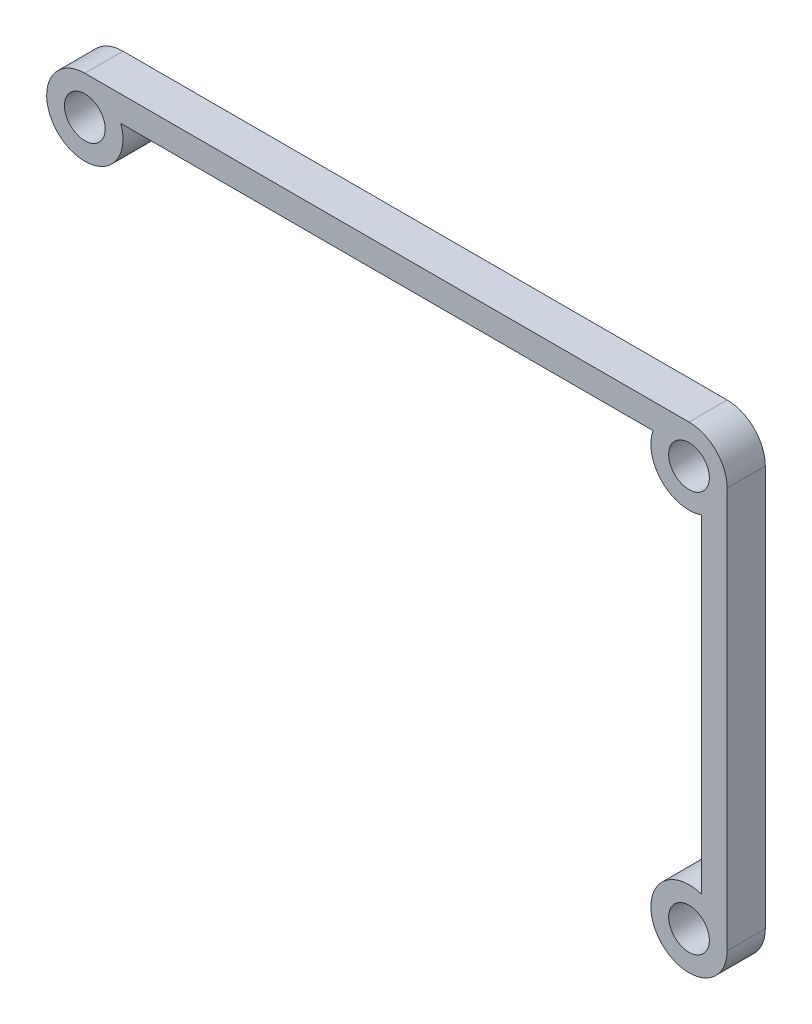
ISO-10303-21;
HEADER;
FILE_DESCRIPTION(('STEP AP214'),'2;1');
FILE_NAME('part.step','',(''),(''),'','','');
FILE_SCHEMA(('AUTOMOTIVE_DESIGN { 1 0 10303 214 1 1 1 1 }'));
ENDSEC;
DATA;
#1=APPLICATION_CONTEXT('core data for automotive mechanical design processes');
#2=APPLICATION_PROTOCOL_DEFINITION('international standard','automotive_design',2000,#1);
#3=PRODUCT_CONTEXT('',#1,'mechanical');
#4=PRODUCT('Part','Part','',(#3));
#5=PRODUCT_RELATED_PRODUCT_CATEGORY('part','',(#4));
#6=PRODUCT_DEFINITION_FORMATION('','',#4);
#7=PRODUCT_DEFINITION_CONTEXT('part definition',#1,'design');
#8=PRODUCT_DEFINITION('design','',#6,#7);
#9=PRODUCT_DEFINITION_SHAPE('','',#8);
#10=(LENGTH_UNIT() NAMED_UNIT(*) SI_UNIT(.MILLI.,.METRE.));
#11=(NAMED_UNIT(*) PLANE_ANGLE_UNIT() SI_UNIT($,.RADIAN.));
#12=(NAMED_UNIT(*) SI_UNIT($,.STERADIAN.) SOLID_ANGLE_UNIT());
#13=UNCERTAINTY_MEASURE_WITH_UNIT(LENGTH_MEASURE(1.E-05),#10,'distance_accuracy_value','');
#14=(GEOMETRIC_REPRESENTATION_CONTEXT(3) GLOBAL_UNCERTAINTY_ASSIGNED_CONTEXT((#13)) GLOBAL_UNIT_ASSIGNED_CONTEXT((#10,
#11,#12)) REPRESENTATION_CONTEXT('',''));
#15=CARTESIAN_POINT('',(0.,0.,0.));
#16=DIRECTION('',(0.,0.,1.));
#17=DIRECTION('',(1.,0.,0.));
#18=AXIS2_PLACEMENT_3D('',#15,#16,#17);
#19=CARTESIAN_POINT('',(23.75,15.75,3.));
#20=DIRECTION('',(0.,0.,-1.));
#21=DIRECTION('',(-1.,0.,0.));
#22=AXIS2_PLACEMENT_3D('',#19,#20,#21);
#23=PLANE('',#22);
#24=CARTESIAN_POINT('',(23.75,15.75,3.));
#25=DIRECTION('',(0.,0.,1.));
#26=DIRECTION('',(-1.,0.,0.));
#27=AXIS2_PLACEMENT_3D('',#24,#25,#26);
#28=CIRCLE('',#27,3.);
#29=CARTESIAN_POINT('',(26.75,15.75,3.));
#30=VERTEX_POINT('',#29);
#31=CARTESIAN_POINT('',(23.75,18.75,3.));
#32=VERTEX_POINT('',#31);
#33=EDGE_CURVE('E145',#30,#32,#28,.T.);
#34=ORIENTED_EDGE('',*,*,#33,.T.);
#35=DIRECTION('',(-1.,0.,0.));
#36=VECTOR('',#35,1.);
#37=CARTESIAN_POINT('',(-23.75,18.75,3.));
#38=LINE('',#37,#36);
#39=CARTESIAN_POINT('',(-23.75,18.75,3.));
#40=VERTEX_POINT('',#39);
#41=EDGE_CURVE('E93',#32,#40,#38,.T.);
#42=ORIENTED_EDGE('',*,*,#41,.T.);
#43=CARTESIAN_POINT('',(-23.75,15.75,3.));
#44=DIRECTION('',(0.,0.,1.));
#45=DIRECTION('',(1.,0.,0.));
#46=AXIS2_PLACEMENT_3D('',#43,#44,#45);
#47=CIRCLE('',#46,3.);
#48=CARTESIAN_POINT('',(-20.9215728752538,16.75,3.));
#49=VERTEX_POINT('',#48);
#50=EDGE_CURVE('E160',#40,#49,#47,.T.);
#51=ORIENTED_EDGE('',*,*,#50,.T.);
#52=DIRECTION('',(1.,0.,0.));
#53=VECTOR('',#52,1.);
#54=CARTESIAN_POINT('',(-20.9215728752538,16.75,3.));
#55=LINE('',#54,#53);
#56=CARTESIAN_POINT('',(20.9215728752538,16.75,3.));
#57=VERTEX_POINT('',#56);
#58=EDGE_CURVE('E173',#49,#57,#55,.T.);
#59=ORIENTED_EDGE('',*,*,#58,.T.);
#60=CARTESIAN_POINT('',(23.75,15.75,3.));
#61=DIRECTION('',(0.,0.,1.));
#62=DIRECTION('',(-1.,0.,0.));
#63=AXIS2_PLACEMENT_3D('',#60,#61,#62);
#64=CIRCLE('',#63,3.);
#65=CARTESIAN_POINT('',(24.75,12.9215728752538,3.));
#66=VERTEX_POINT('',#65);
#67=EDGE_CURVE('E112',#57,#66,#64,.T.);
#68=ORIENTED_EDGE('',*,*,#67,.T.);
#69=DIRECTION('',(0.,-1.,0.));
#70=VECTOR('',#69,1.);
#71=CARTESIAN_POINT('',(24.75,12.9215728752538,3.));
#72=LINE('',#71,#70);
#73=CARTESIAN_POINT('',(24.75,-12.9215728752538,3.));
#74=VERTEX_POINT('',#73);
#75=EDGE_CURVE('E106',#66,#74,#72,.T.);
#76=ORIENTED_EDGE('',*,*,#75,.T.);
#77=CARTESIAN_POINT('',(23.75,-15.75,3.));
#78=DIRECTION('',(0.,0.,1.));
#79=DIRECTION('',(1.,0.,0.));
#80=AXIS2_PLACEMENT_3D('',#77,#78,#79);
#81=CIRCLE('',#80,3.);
#82=CARTESIAN_POINT('',(26.75,-15.75,3.));
#83=VERTEX_POINT('',#82);
#84=EDGE_CURVE('E110',#74,#83,#81,.T.);
#85=ORIENTED_EDGE('',*,*,#84,.T.);
#86=DIRECTION('',(0.,1.,0.));
#87=VECTOR('',#86,1.);
#88=CARTESIAN_POINT('',(26.75,15.75,3.));
#89=LINE('',#88,#87);
#90=EDGE_CURVE('E50',#83,#30,#89,.T.);
#91=ORIENTED_EDGE('',*,*,#90,.T.);
#92=EDGE_LOOP('',(#34,#42,#51,#59,#68,#76,#85,#91));
#93=FACE_BOUND('',#92,.T.);
#94=CARTESIAN_POINT('',(-23.75,15.75,3.));
#95=DIRECTION('',(0.,0.,1.));
#96=DIRECTION('',(1.,0.,0.));
#97=AXIS2_PLACEMENT_3D('',#94,#95,#96);
#98=CIRCLE('',#97,1.6);
#99=CARTESIAN_POINT('',(-22.15,15.75,3.));
#100=VERTEX_POINT('',#99);
#101=EDGE_CURVE('E134',#100,#100,#98,.T.);
#102=ORIENTED_EDGE('',*,*,#101,.F.);
#103=EDGE_LOOP('',(#102));
#104=FACE_BOUND('',#103,.T.);
#105=CARTESIAN_POINT('',(23.75,15.75,3.));
#106=DIRECTION('',(0.,0.,1.));
#107=DIRECTION('',(-1.,0.,0.));
#108=AXIS2_PLACEMENT_3D('',#105,#106,#107);
#109=CIRCLE('',#108,1.6);
#110=CARTESIAN_POINT('',(22.15,15.75,3.));
#111=VERTEX_POINT('',#110);
#112=EDGE_CURVE('E182',#111,#111,#109,.T.);
#113=ORIENTED_EDGE('',*,*,#112,.F.);
#114=EDGE_LOOP('',(#113));
#115=FACE_BOUND('',#114,.T.);
#116=CARTESIAN_POINT('',(23.75,-15.75,3.));
#117=DIRECTION('',(0.,0.,1.));
#118=DIRECTION('',(1.,0.,0.));
#119=AXIS2_PLACEMENT_3D('',#116,#117,#118);
#120=CIRCLE('',#119,1.6);
#121=CARTESIAN_POINT('',(25.35,-15.75,3.));
#122=VERTEX_POINT('',#121);
#123=EDGE_CURVE('E188',#122,#122,#120,.T.);
#124=ORIENTED_EDGE('',*,*,#123,.F.);
#125=EDGE_LOOP('',(#124));
#126=FACE_BOUND('',#125,.T.);
#127=ADVANCED_FACE('F33',(#93,#104,#115,#126),#23,.F.);
#128=CARTESIAN_POINT('',(23.75,15.75,0.));
#129=DIRECTION('',(0.,0.,-1.));
#130=DIRECTION('',(-1.,0.,0.));
#131=AXIS2_PLACEMENT_3D('',#128,#129,#130);
#132=PLANE('',#131);
#133=CARTESIAN_POINT('',(23.75,15.75,0.));
#134=DIRECTION('',(0.,0.,1.));
#135=DIRECTION('',(-1.,0.,0.));
#136=AXIS2_PLACEMENT_3D('',#133,#134,#135);
#137=CIRCLE('',#136,1.6);
#138=CARTESIAN_POINT('',(22.15,15.75,0.));
#139=VERTEX_POINT('',#138);
#140=EDGE_CURVE('E185',#139,#139,#137,.T.);
#141=ORIENTED_EDGE('',*,*,#140,.T.);
#142=EDGE_LOOP('',(#141));
#143=FACE_BOUND('',#142,.T.);
#144=CARTESIAN_POINT('',(23.75,15.75,0.));
#145=DIRECTION('',(0.,0.,1.));
#146=DIRECTION('',(-1.,0.,0.));
#147=AXIS2_PLACEMENT_3D('',#144,#145,#146);
#148=CIRCLE('',#147,3.);
#149=CARTESIAN_POINT('',(26.75,15.75,0.));
#150=VERTEX_POINT('',#149);
#151=CARTESIAN_POINT('',(23.75,18.75,0.));
#152=VERTEX_POINT('',#151);
#153=EDGE_CURVE('E130',#150,#152,#148,.T.);
#154=ORIENTED_EDGE('',*,*,#153,.F.);
#155=DIRECTION('',(0.,1.,0.));
#156=VECTOR('',#155,1.);
#157=CARTESIAN_POINT('',(26.75,15.75,0.));
#158=LINE('',#157,#156);
#159=CARTESIAN_POINT('',(26.75,-15.75,0.));
#160=VERTEX_POINT('',#159);
#161=EDGE_CURVE('E85',#160,#150,#158,.T.);
#162=ORIENTED_EDGE('',*,*,#161,.F.);
#163=CARTESIAN_POINT('',(23.75,-15.75,0.));
#164=DIRECTION('',(0.,0.,1.));
#165=DIRECTION('',(1.,0.,0.));
#166=AXIS2_PLACEMENT_3D('',#163,#164,#165);
#167=CIRCLE('',#166,3.);
#168=CARTESIAN_POINT('',(24.75,-12.9215728752538,0.));
#169=VERTEX_POINT('',#168);
#170=EDGE_CURVE('E79',#169,#160,#167,.T.);
#171=ORIENTED_EDGE('',*,*,#170,.F.);
#172=DIRECTION('',(0.,-1.,0.));
#173=VECTOR('',#172,1.);
#174=CARTESIAN_POINT('',(24.75,12.9215728752538,0.));
#175=LINE('',#174,#173);
#176=CARTESIAN_POINT('',(24.75,12.9215728752538,0.));
#177=VERTEX_POINT('',#176);
#178=EDGE_CURVE('E120',#177,#169,#175,.T.);
#179=ORIENTED_EDGE('',*,*,#178,.F.);
#180=CARTESIAN_POINT('',(23.75,15.75,0.));
#181=DIRECTION('',(0.,0.,1.));
#182=DIRECTION('',(-1.,0.,0.));
#183=AXIS2_PLACEMENT_3D('',#180,#181,#182);
#184=CIRCLE('',#183,3.);
#185=CARTESIAN_POINT('',(20.9215728752538,16.75,0.));
#186=VERTEX_POINT('',#185);
#187=EDGE_CURVE('E140',#186,#177,#184,.T.);
#188=ORIENTED_EDGE('',*,*,#187,.F.);
#189=DIRECTION('',(1.,0.,0.));
#190=VECTOR('',#189,1.);
#191=CARTESIAN_POINT('',(-20.9215728752538,16.75,0.));
#192=LINE('',#191,#190);
#193=CARTESIAN_POINT('',(-20.9215728752538,16.75,0.));
#194=VERTEX_POINT('',#193);
#195=EDGE_CURVE('E138',#194,#186,#192,.T.);
#196=ORIENTED_EDGE('',*,*,#195,.F.);
#197=CARTESIAN_POINT('',(-23.75,15.75,0.));
#198=DIRECTION('',(0.,0.,1.));
#199=DIRECTION('',(1.,0.,0.));
#200=AXIS2_PLACEMENT_3D('',#197,#198,#199);
#201=CIRCLE('',#200,3.);
#202=CARTESIAN_POINT('',(-23.75,18.75,0.));
#203=VERTEX_POINT('',#202);
#204=EDGE_CURVE('E136',#203,#194,#201,.T.);
#205=ORIENTED_EDGE('',*,*,#204,.F.);
#206=DIRECTION('',(-1.,0.,0.));
#207=VECTOR('',#206,1.);
#208=CARTESIAN_POINT('',(-23.75,18.75,0.));
#209=LINE('',#208,#207);
#210=EDGE_CURVE('E133',#152,#203,#209,.T.);
#211=ORIENTED_EDGE('',*,*,#210,.F.);
#212=EDGE_LOOP('',(#154,#162,#171,#179,#188,#196,#205,#211));
#213=FACE_BOUND('',#212,.T.);
#214=CARTESIAN_POINT('',(-23.75,15.75,0.));
#215=DIRECTION('',(0.,0.,1.));
#216=DIRECTION('',(1.,0.,0.));
#217=AXIS2_PLACEMENT_3D('',#214,#215,#216);
#218=CIRCLE('',#217,1.6);
#219=CARTESIAN_POINT('',(-22.15,15.75,0.));
#220=VERTEX_POINT('',#219);
#221=EDGE_CURVE('E179',#220,#220,#218,.T.);
#222=ORIENTED_EDGE('',*,*,#221,.T.);
#223=EDGE_LOOP('',(#222));
#224=FACE_BOUND('',#223,.T.);
#225=CARTESIAN_POINT('',(23.75,-15.75,0.));
#226=DIRECTION('',(0.,0.,1.));
#227=DIRECTION('',(1.,0.,0.));
#228=AXIS2_PLACEMENT_3D('',#225,#226,#227);
#229=CIRCLE('',#228,1.6);
#230=CARTESIAN_POINT('',(25.35,-15.75,0.));
#231=VERTEX_POINT('',#230);
#232=EDGE_CURVE('E191',#231,#231,#229,.T.);
#233=ORIENTED_EDGE('',*,*,#232,.T.);
#234=EDGE_LOOP('',(#233));
#235=FACE_BOUND('',#234,.T.);
#236=ADVANCED_FACE('F164',(#143,#213,#224,#235),#132,.T.);
#237=CARTESIAN_POINT('',(23.75,15.75,3.));
#238=DIRECTION('',(0.,0.,-1.));
#239=DIRECTION('',(-1.,0.,0.));
#240=AXIS2_PLACEMENT_3D('',#237,#238,#239);
#241=CYLINDRICAL_SURFACE('',#240,3.);
#242=ORIENTED_EDGE('',*,*,#153,.T.);
#243=DIRECTION('',(0.,0.,-1.));
#244=VECTOR('',#243,1.);
#245=CARTESIAN_POINT('',(23.75,18.75,3.));
#246=LINE('',#245,#244);
#247=EDGE_CURVE('E11',#32,#152,#246,.T.);
#248=ORIENTED_EDGE('',*,*,#247,.F.);
#249=ORIENTED_EDGE('',*,*,#33,.F.);
#250=DIRECTION('',(0.,0.,-1.));
#251=VECTOR('',#250,1.);
#252=CARTESIAN_POINT('',(26.75,15.75,3.));
#253=LINE('',#252,#251);
#254=EDGE_CURVE('E126',#30,#150,#253,.T.);
#255=ORIENTED_EDGE('',*,*,#254,.T.);
#256=EDGE_LOOP('',(#242,#248,#249,#255));
#257=FACE_BOUND('',#256,.T.);
#258=ADVANCED_FACE('F35',(#257),#241,.T.);
#259=CARTESIAN_POINT('',(-23.75,18.75,3.));
#260=DIRECTION('',(0.,-1.,0.));
#261=DIRECTION('',(1.,0.,0.));
#262=AXIS2_PLACEMENT_3D('',#259,#260,#261);
#263=PLANE('',#262);
#264=ORIENTED_EDGE('',*,*,#210,.T.);
#265=DIRECTION('',(0.,0.,-1.));
#266=VECTOR('',#265,1.);
#267=CARTESIAN_POINT('',(-23.75,18.75,3.));
#268=LINE('',#267,#266);
#269=EDGE_CURVE('E42',#40,#203,#268,.T.);
#270=ORIENTED_EDGE('',*,*,#269,.F.);
#271=ORIENTED_EDGE('',*,*,#41,.F.);
#272=ORIENTED_EDGE('',*,*,#247,.T.);
#273=EDGE_LOOP('',(#264,#270,#271,#272));
#274=FACE_BOUND('',#273,.T.);
#275=ADVANCED_FACE('F223',(#274),#263,.F.);
#276=CARTESIAN_POINT('',(-23.75,15.75,3.));
#277=DIRECTION('',(0.,0.,-1.));
#278=DIRECTION('',(-1.,0.,0.));
#279=AXIS2_PLACEMENT_3D('',#276,#277,#278);
#280=CYLINDRICAL_SURFACE('',#279,3.);
#281=ORIENTED_EDGE('',*,*,#204,.T.);
#282=DIRECTION('',(0.,0.,-1.));
#283=VECTOR('',#282,1.);
#284=CARTESIAN_POINT('',(-20.9215728752538,16.75,3.));
#285=LINE('',#284,#283);
#286=EDGE_CURVE('E152',#49,#194,#285,.T.);
#287=ORIENTED_EDGE('',*,*,#286,.F.);
#288=ORIENTED_EDGE('',*,*,#50,.F.);
#289=ORIENTED_EDGE('',*,*,#269,.T.);
#290=EDGE_LOOP('',(#281,#287,#288,#289));
#291=FACE_BOUND('',#290,.T.);
#292=ADVANCED_FACE('F158',(#291),#280,.T.);
#293=CARTESIAN_POINT('',(-20.9215728752538,16.75,3.));
#294=DIRECTION('',(0.,1.,0.));
#295=DIRECTION('',(-1.,0.,0.));
#296=AXIS2_PLACEMENT_3D('',#293,#294,#295);
#297=PLANE('',#296);
#298=ORIENTED_EDGE('',*,*,#195,.T.);
#299=DIRECTION('',(0.,0.,-1.));
#300=VECTOR('',#299,1.);
#301=CARTESIAN_POINT('',(20.9215728752538,16.75,3.));
#302=LINE('',#301,#300);
#303=EDGE_CURVE('E149',#57,#186,#302,.T.);
#304=ORIENTED_EDGE('',*,*,#303,.F.);
#305=ORIENTED_EDGE('',*,*,#58,.F.);
#306=ORIENTED_EDGE('',*,*,#286,.T.);
#307=EDGE_LOOP('',(#298,#304,#305,#306));
#308=FACE_BOUND('',#307,.T.);
#309=ADVANCED_FACE('F169',(#308),#297,.F.);
#310=CARTESIAN_POINT('',(23.75,15.75,3.));
#311=DIRECTION('',(0.,0.,-1.));
#312=DIRECTION('',(-1.,0.,0.));
#313=AXIS2_PLACEMENT_3D('',#310,#311,#312);
#314=CYLINDRICAL_SURFACE('',#313,3.);
#315=ORIENTED_EDGE('',*,*,#187,.T.);
#316=DIRECTION('',(0.,0.,-1.));
#317=VECTOR('',#316,1.);
#318=CARTESIAN_POINT('',(24.75,12.9215728752538,3.));
#319=LINE('',#318,#317);
#320=EDGE_CURVE('E121',#66,#177,#319,.T.);
#321=ORIENTED_EDGE('',*,*,#320,.F.);
#322=ORIENTED_EDGE('',*,*,#67,.F.);
#323=ORIENTED_EDGE('',*,*,#303,.T.);
#324=EDGE_LOOP('',(#315,#321,#322,#323));
#325=FACE_BOUND('',#324,.T.);
#326=ADVANCED_FACE('F172',(#325),#314,.T.);
#327=CARTESIAN_POINT('',(24.75,12.9215728752538,3.));
#328=DIRECTION('',(1.,0.,0.));
#329=DIRECTION('',(0.,0.,-1.));
#330=AXIS2_PLACEMENT_3D('',#327,#328,#329);
#331=PLANE('',#330);
#332=ORIENTED_EDGE('',*,*,#178,.T.);
#333=DIRECTION('',(0.,0.,-1.));
#334=VECTOR('',#333,1.);
#335=CARTESIAN_POINT('',(24.75,-12.9215728752538,3.));
#336=LINE('',#335,#334);
#337=EDGE_CURVE('E117',#74,#169,#336,.T.);
#338=ORIENTED_EDGE('',*,*,#337,.F.);
#339=ORIENTED_EDGE('',*,*,#75,.F.);
#340=ORIENTED_EDGE('',*,*,#320,.T.);
#341=EDGE_LOOP('',(#332,#338,#339,#340));
#342=FACE_BOUND('',#341,.T.);
#343=ADVANCED_FACE('F118',(#342),#331,.F.);
#344=CARTESIAN_POINT('',(23.75,-15.75,3.));
#345=DIRECTION('',(0.,0.,-1.));
#346=DIRECTION('',(-1.,0.,0.));
#347=AXIS2_PLACEMENT_3D('',#344,#345,#346);
#348=CYLINDRICAL_SURFACE('',#347,3.);
#349=ORIENTED_EDGE('',*,*,#170,.T.);
#350=DIRECTION('',(0.,0.,-1.));
#351=VECTOR('',#350,1.);
#352=CARTESIAN_POINT('',(26.75,-15.75,3.));
#353=LINE('',#352,#351);
#354=EDGE_CURVE('E122',#83,#160,#353,.T.);
#355=ORIENTED_EDGE('',*,*,#354,.F.);
#356=ORIENTED_EDGE('',*,*,#84,.F.);
#357=ORIENTED_EDGE('',*,*,#337,.T.);
#358=EDGE_LOOP('',(#349,#355,#356,#357));
#359=FACE_BOUND('',#358,.T.);
#360=ADVANCED_FACE('F124',(#359),#348,.T.);
#361=CARTESIAN_POINT('',(26.75,15.75,3.));
#362=DIRECTION('',(-1.,0.,0.));
#363=DIRECTION('',(0.,0.,1.));
#364=AXIS2_PLACEMENT_3D('',#361,#362,#363);
#365=PLANE('',#364);
#366=ORIENTED_EDGE('',*,*,#161,.T.);
#367=ORIENTED_EDGE('',*,*,#254,.F.);
#368=ORIENTED_EDGE('',*,*,#90,.F.);
#369=ORIENTED_EDGE('',*,*,#354,.T.);
#370=EDGE_LOOP('',(#366,#367,#368,#369));
#371=FACE_BOUND('',#370,.T.);
#372=ADVANCED_FACE('F211',(#371),#365,.F.);
#373=CARTESIAN_POINT('',(-23.75,15.75,3.));
#374=DIRECTION('',(0.,0.,-1.));
#375=DIRECTION('',(-1.,0.,0.));
#376=AXIS2_PLACEMENT_3D('',#373,#374,#375);
#377=CYLINDRICAL_SURFACE('',#376,1.6);
#378=ORIENTED_EDGE('',*,*,#101,.T.);
#379=EDGE_LOOP('',(#378));
#380=FACE_BOUND('',#379,.T.);
#381=ORIENTED_EDGE('',*,*,#221,.F.);
#382=EDGE_LOOP('',(#381));
#383=FACE_BOUND('',#382,.T.);
#384=ADVANCED_FACE('F208',(#380,#383),#377,.F.);
#385=CARTESIAN_POINT('',(23.75,15.75,3.));
#386=DIRECTION('',(0.,0.,-1.));
#387=DIRECTION('',(-1.,0.,0.));
#388=AXIS2_PLACEMENT_3D('',#385,#386,#387);
#389=CYLINDRICAL_SURFACE('',#388,1.6);
#390=ORIENTED_EDGE('',*,*,#112,.T.);
#391=EDGE_LOOP('',(#390));
#392=FACE_BOUND('',#391,.T.);
#393=ORIENTED_EDGE('',*,*,#140,.F.);
#394=EDGE_LOOP('',(#393));
#395=FACE_BOUND('',#394,.T.);
#396=ADVANCED_FACE('F287',(#392,#395),#389,.F.);
#397=CARTESIAN_POINT('',(23.75,-15.75,3.));
#398=DIRECTION('',(0.,0.,-1.));
#399=DIRECTION('',(-1.,0.,0.));
#400=AXIS2_PLACEMENT_3D('',#397,#398,#399);
#401=CYLINDRICAL_SURFACE('',#400,1.6);
#402=ORIENTED_EDGE('',*,*,#123,.T.);
#403=EDGE_LOOP('',(#402));
#404=FACE_BOUND('',#403,.T.);
#405=ORIENTED_EDGE('',*,*,#232,.F.);
#406=EDGE_LOOP('',(#405));
#407=FACE_BOUND('',#406,.T.);
#408=ADVANCED_FACE('F197',(#404,#407),#401,.F.);
#409=CLOSED_SHELL('',(#127,#236,#258,#275,#292,#309,#326,#343,#360,#372,#384,#396,#408));
#410=MANIFOLD_SOLID_BREP('B2',#409);
#411=ADVANCED_BREP_SHAPE_REPRESENTATION('',(#18,#410),#14);
#412=SHAPE_DEFINITION_REPRESENTATION(#9,#411);
ENDSEC;
END-ISO-10303-21;
